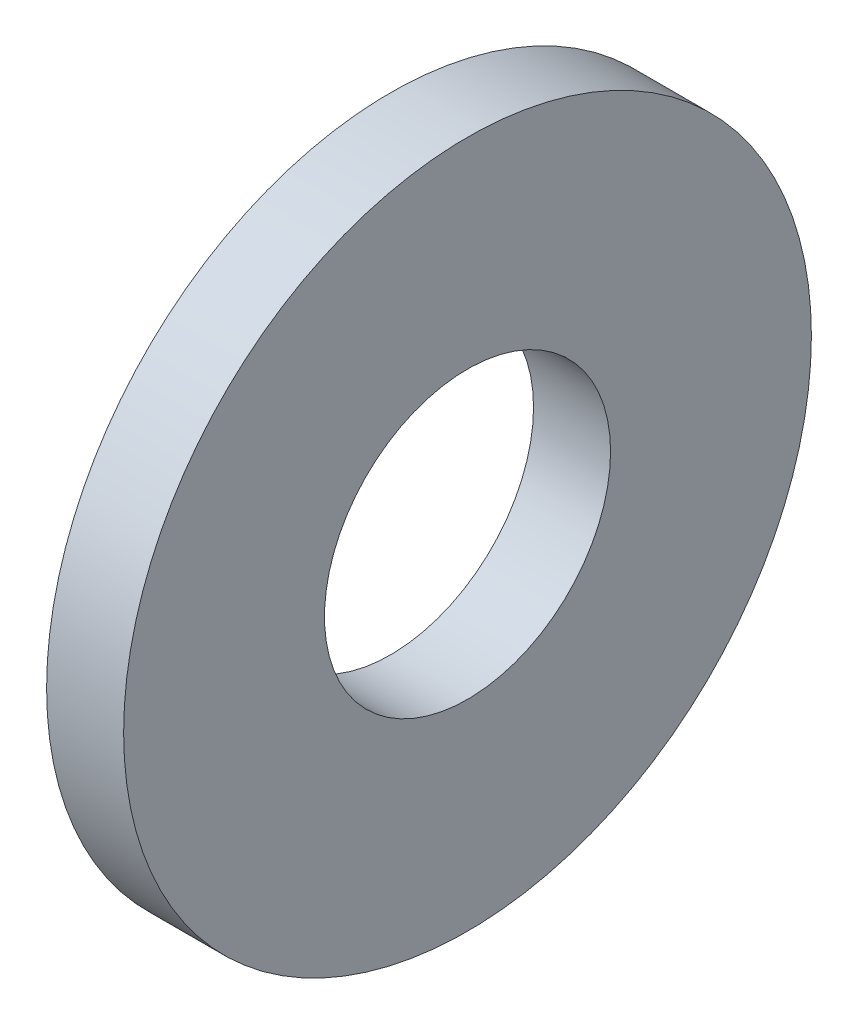
ISO-10303-21;
HEADER;
FILE_DESCRIPTION(('STEP AP214'),'2;1');
FILE_NAME('part.step','',(''),(''),'','','');
FILE_SCHEMA(('AUTOMOTIVE_DESIGN { 1 0 10303 214 1 1 1 1 }'));
ENDSEC;
DATA;
#1=APPLICATION_CONTEXT('core data for automotive mechanical design processes');
#2=APPLICATION_PROTOCOL_DEFINITION('international standard','automotive_design',2000,#1);
#3=PRODUCT_CONTEXT('',#1,'mechanical');
#4=PRODUCT('Part','Part','',(#3));
#5=PRODUCT_RELATED_PRODUCT_CATEGORY('part','',(#4));
#6=PRODUCT_DEFINITION_FORMATION('','',#4);
#7=PRODUCT_DEFINITION_CONTEXT('part definition',#1,'design');
#8=PRODUCT_DEFINITION('design','',#6,#7);
#9=PRODUCT_DEFINITION_SHAPE('','',#8);
#10=(LENGTH_UNIT() NAMED_UNIT(*) SI_UNIT(.MILLI.,.METRE.));
#11=(NAMED_UNIT(*) PLANE_ANGLE_UNIT() SI_UNIT($,.RADIAN.));
#12=(NAMED_UNIT(*) SI_UNIT($,.STERADIAN.) SOLID_ANGLE_UNIT());
#13=UNCERTAINTY_MEASURE_WITH_UNIT(LENGTH_MEASURE(1.E-05),#10,'distance_accuracy_value','');
#14=(GEOMETRIC_REPRESENTATION_CONTEXT(3) GLOBAL_UNCERTAINTY_ASSIGNED_CONTEXT((#13)) GLOBAL_UNIT_ASSIGNED_CONTEXT((#10,
#11,#12)) REPRESENTATION_CONTEXT('',''));
#15=CARTESIAN_POINT('',(0.,0.,0.));
#16=DIRECTION('',(0.,0.,1.));
#17=DIRECTION('',(1.,0.,0.));
#18=AXIS2_PLACEMENT_3D('',#15,#16,#17);
#19=CARTESIAN_POINT('',(1.778,0.,0.));
#20=DIRECTION('',(1.,0.,0.));
#21=DIRECTION('',(0.,0.,-1.));
#22=AXIS2_PLACEMENT_3D('',#19,#20,#21);
#23=PLANE('',#22);
#24=CARTESIAN_POINT('',(1.778,0.,0.));
#25=DIRECTION('',(1.,0.,0.));
#26=DIRECTION('',(0.,0.,-1.));
#27=AXIS2_PLACEMENT_3D('',#24,#25,#26);
#28=CIRCLE('',#27,7.9375);
#29=CARTESIAN_POINT('',(1.778,0.,-7.9375));
#30=VERTEX_POINT('',#29);
#31=EDGE_CURVE('E10',#30,#30,#28,.T.);
#32=ORIENTED_EDGE('',*,*,#31,.T.);
#33=EDGE_LOOP('',(#32));
#34=FACE_BOUND('',#33,.T.);
#35=CARTESIAN_POINT('',(1.778,0.,0.));
#36=DIRECTION('',(1.,0.,0.));
#37=DIRECTION('',(0.,0.,-1.));
#38=AXIS2_PLACEMENT_3D('',#35,#36,#37);
#39=CIRCLE('',#38,3.302);
#40=CARTESIAN_POINT('',(1.778,0.,-3.302));
#41=VERTEX_POINT('',#40);
#42=EDGE_CURVE('E42',#41,#41,#39,.T.);
#43=ORIENTED_EDGE('',*,*,#42,.F.);
#44=EDGE_LOOP('',(#43));
#45=FACE_BOUND('',#44,.T.);
#46=ADVANCED_FACE('F31',(#34,#45),#23,.T.);
#47=CARTESIAN_POINT('',(0.,0.,0.));
#48=DIRECTION('',(1.,0.,0.));
#49=DIRECTION('',(0.,0.,-1.));
#50=AXIS2_PLACEMENT_3D('',#47,#48,#49);
#51=PLANE('',#50);
#52=CARTESIAN_POINT('',(0.,0.,0.));
#53=DIRECTION('',(1.,0.,0.));
#54=DIRECTION('',(0.,0.,-1.));
#55=AXIS2_PLACEMENT_3D('',#52,#53,#54);
#56=CIRCLE('',#55,7.9375);
#57=CARTESIAN_POINT('',(0.,0.,-7.9375));
#58=VERTEX_POINT('',#57);
#59=EDGE_CURVE('E35',#58,#58,#56,.T.);
#60=ORIENTED_EDGE('',*,*,#59,.F.);
#61=EDGE_LOOP('',(#60));
#62=FACE_BOUND('',#61,.T.);
#63=CARTESIAN_POINT('',(0.,0.,0.));
#64=DIRECTION('',(1.,0.,0.));
#65=DIRECTION('',(0.,0.,-1.));
#66=AXIS2_PLACEMENT_3D('',#63,#64,#65);
#67=CIRCLE('',#66,3.302);
#68=CARTESIAN_POINT('',(0.,0.,-3.302));
#69=VERTEX_POINT('',#68);
#70=EDGE_CURVE('E44',#69,#69,#67,.T.);
#71=ORIENTED_EDGE('',*,*,#70,.T.);
#72=EDGE_LOOP('',(#71));
#73=FACE_BOUND('',#72,.T.);
#74=ADVANCED_FACE('F54',(#62,#73),#51,.F.);
#75=CARTESIAN_POINT('',(1.778,0.,0.));
#76=DIRECTION('',(-1.,0.,0.));
#77=DIRECTION('',(0.,0.,1.));
#78=AXIS2_PLACEMENT_3D('',#75,#76,#77);
#79=CYLINDRICAL_SURFACE('',#78,7.9375);
#80=ORIENTED_EDGE('',*,*,#31,.F.);
#81=EDGE_LOOP('',(#80));
#82=FACE_BOUND('',#81,.T.);
#83=ORIENTED_EDGE('',*,*,#59,.T.);
#84=EDGE_LOOP('',(#83));
#85=FACE_BOUND('',#84,.T.);
#86=ADVANCED_FACE('F33',(#82,#85),#79,.T.);
#87=CARTESIAN_POINT('',(1.778,0.,0.));
#88=DIRECTION('',(-1.,0.,0.));
#89=DIRECTION('',(0.,0.,1.));
#90=AXIS2_PLACEMENT_3D('',#87,#88,#89);
#91=CYLINDRICAL_SURFACE('',#90,3.302);
#92=ORIENTED_EDGE('',*,*,#42,.T.);
#93=EDGE_LOOP('',(#92));
#94=FACE_BOUND('',#93,.T.);
#95=ORIENTED_EDGE('',*,*,#70,.F.);
#96=EDGE_LOOP('',(#95));
#97=FACE_BOUND('',#96,.T.);
#98=ADVANCED_FACE('F50',(#94,#97),#91,.F.);
#99=CLOSED_SHELL('',(#46,#74,#86,#98));
#100=MANIFOLD_SOLID_BREP('B2',#99);
#101=ADVANCED_BREP_SHAPE_REPRESENTATION('',(#18,#100),#14);
#102=SHAPE_DEFINITION_REPRESENTATION(#9,#101);
ENDSEC;
END-ISO-10303-21;
